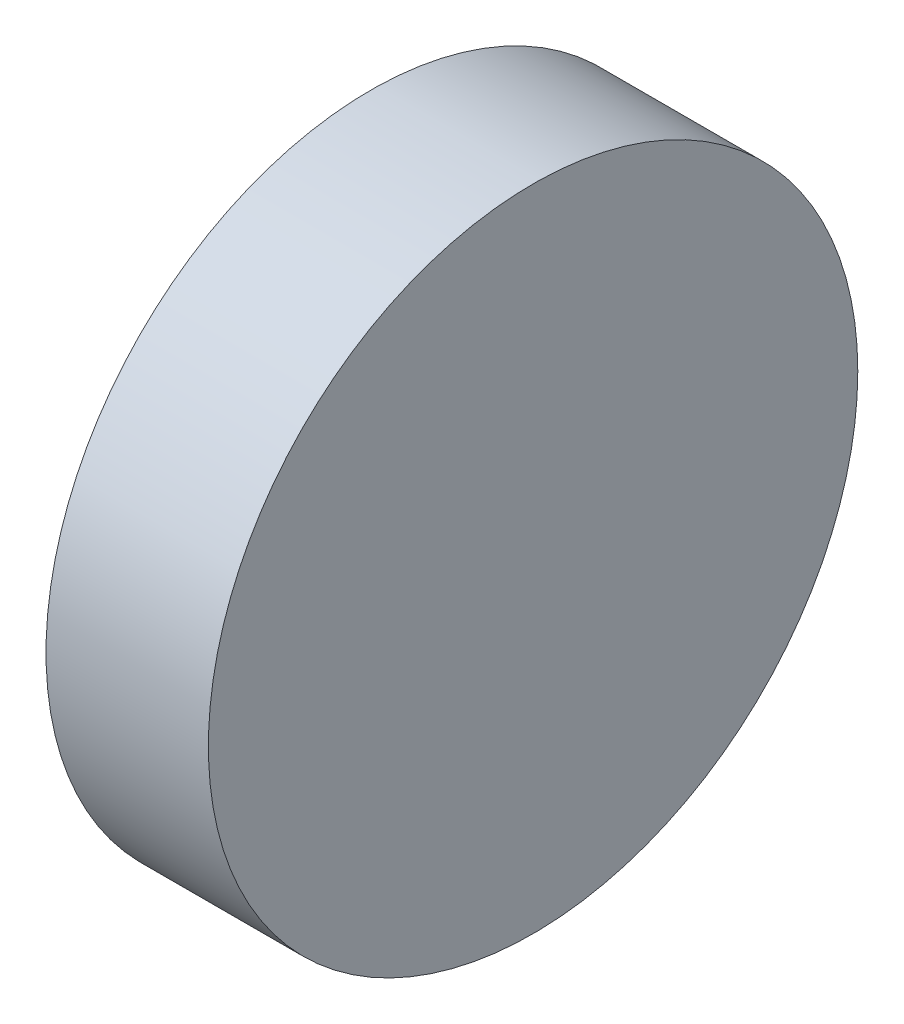
ISO-10303-21;
HEADER;
FILE_DESCRIPTION(('STEP AP214'),'2;1');
FILE_NAME('part.step','',(''),(''),'','','');
FILE_SCHEMA(('AUTOMOTIVE_DESIGN { 1 0 10303 214 1 1 1 1 }'));
ENDSEC;
DATA;
#1=APPLICATION_CONTEXT('core data for automotive mechanical design processes');
#2=APPLICATION_PROTOCOL_DEFINITION('international standard','automotive_design',2000,#1);
#3=PRODUCT_CONTEXT('',#1,'mechanical');
#4=PRODUCT('Part','Part','',(#3));
#5=PRODUCT_RELATED_PRODUCT_CATEGORY('part','',(#4));
#6=PRODUCT_DEFINITION_FORMATION('','',#4);
#7=PRODUCT_DEFINITION_CONTEXT('part definition',#1,'design');
#8=PRODUCT_DEFINITION('design','',#6,#7);
#9=PRODUCT_DEFINITION_SHAPE('','',#8);
#10=(LENGTH_UNIT() NAMED_UNIT(*) SI_UNIT(.MILLI.,.METRE.));
#11=(NAMED_UNIT(*) PLANE_ANGLE_UNIT() SI_UNIT($,.RADIAN.));
#12=(NAMED_UNIT(*) SI_UNIT($,.STERADIAN.) SOLID_ANGLE_UNIT());
#13=UNCERTAINTY_MEASURE_WITH_UNIT(LENGTH_MEASURE(1.E-05),#10,'distance_accuracy_value','');
#14=(GEOMETRIC_REPRESENTATION_CONTEXT(3) GLOBAL_UNCERTAINTY_ASSIGNED_CONTEXT((#13)) GLOBAL_UNIT_ASSIGNED_CONTEXT((#10,
#11,#12)) REPRESENTATION_CONTEXT('',''));
#15=CARTESIAN_POINT('',(0.,0.,0.));
#16=DIRECTION('',(0.,0.,1.));
#17=DIRECTION('',(1.,0.,0.));
#18=AXIS2_PLACEMENT_3D('',#15,#16,#17);
#19=CARTESIAN_POINT('',(3409.41974930031,-50.5543928577481,-50.3392616828364));
#20=DIRECTION('',(-1.,0.,0.));
#21=DIRECTION('',(0.,0.,1.));
#22=AXIS2_PLACEMENT_3D('',#19,#20,#21);
#23=CYLINDRICAL_SURFACE('',#22,600.);
#24=CARTESIAN_POINT('',(3409.41974930031,-50.5543928577481,-50.3392616828364));
#25=DIRECTION('',(1.,0.,0.));
#26=DIRECTION('',(0.,0.,-1.));
#27=AXIS2_PLACEMENT_3D('',#24,#25,#26);
#28=CIRCLE('',#27,600.);
#29=CARTESIAN_POINT('',(3409.41974930031,-50.5543928577481,-650.339261682837));
#30=VERTEX_POINT('',#29);
#31=EDGE_CURVE('E10',#30,#30,#28,.T.);
#32=ORIENTED_EDGE('',*,*,#31,.F.);
#33=EDGE_LOOP('',(#32));
#34=FACE_BOUND('',#33,.T.);
#35=CARTESIAN_POINT('',(3109.41974930031,-50.5543928577481,-50.3392616828364));
#36=DIRECTION('',(1.,0.,0.));
#37=DIRECTION('',(0.,0.,-1.));
#38=AXIS2_PLACEMENT_3D('',#35,#36,#37);
#39=CIRCLE('',#38,600.);
#40=CARTESIAN_POINT('',(3109.41974930031,-50.5543928577481,-650.339261682837));
#41=VERTEX_POINT('',#40);
#42=EDGE_CURVE('E31',#41,#41,#39,.T.);
#43=ORIENTED_EDGE('',*,*,#42,.T.);
#44=EDGE_LOOP('',(#43));
#45=FACE_BOUND('',#44,.T.);
#46=ADVANCED_FACE('F28',(#34,#45),#23,.T.);
#47=CARTESIAN_POINT('',(3409.41974930031,-50.5543928577481,-50.3392616828364));
#48=DIRECTION('',(1.,0.,0.));
#49=DIRECTION('',(0.,0.,-1.));
#50=AXIS2_PLACEMENT_3D('',#47,#48,#49);
#51=PLANE('',#50);
#52=ORIENTED_EDGE('',*,*,#31,.T.);
#53=EDGE_LOOP('',(#52));
#54=FACE_BOUND('',#53,.T.);
#55=ADVANCED_FACE('F43',(#54),#51,.T.);
#56=CARTESIAN_POINT('',(3109.41974930031,-50.5543928577481,-50.3392616828364));
#57=DIRECTION('',(1.,0.,0.));
#58=DIRECTION('',(0.,0.,-1.));
#59=AXIS2_PLACEMENT_3D('',#56,#57,#58);
#60=PLANE('',#59);
#61=ORIENTED_EDGE('',*,*,#42,.F.);
#62=EDGE_LOOP('',(#61));
#63=FACE_BOUND('',#62,.T.);
#64=ADVANCED_FACE('F41',(#63),#60,.F.);
#65=CLOSED_SHELL('',(#46,#55,#64));
#66=MANIFOLD_SOLID_BREP('B2',#65);
#67=ADVANCED_BREP_SHAPE_REPRESENTATION('',(#18,#66),#14);
#68=SHAPE_DEFINITION_REPRESENTATION(#9,#67);
ENDSEC;
END-ISO-10303-21;
